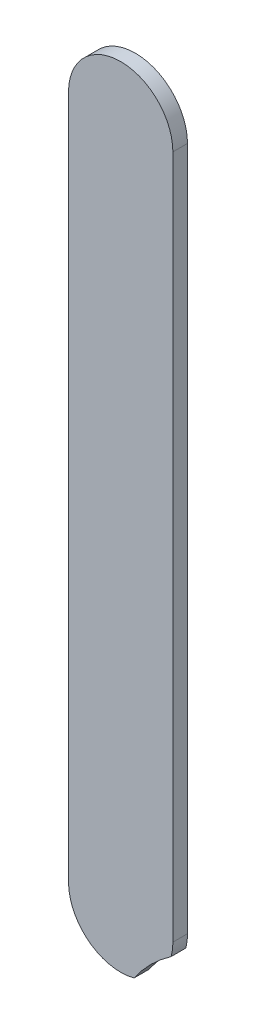
ISO-10303-21;
HEADER;
FILE_DESCRIPTION(('STEP AP214'),'2;1');
FILE_NAME('part.step','',(''),(''),'','','');
FILE_SCHEMA(('AUTOMOTIVE_DESIGN { 1 0 10303 214 1 1 1 1 }'));
ENDSEC;
DATA;
#1=APPLICATION_CONTEXT('core data for automotive mechanical design processes');
#2=APPLICATION_PROTOCOL_DEFINITION('international standard','automotive_design',2000,#1);
#3=PRODUCT_CONTEXT('',#1,'mechanical');
#4=PRODUCT('Part','Part','',(#3));
#5=PRODUCT_RELATED_PRODUCT_CATEGORY('part','',(#4));
#6=PRODUCT_DEFINITION_FORMATION('','',#4);
#7=PRODUCT_DEFINITION_CONTEXT('part definition',#1,'design');
#8=PRODUCT_DEFINITION('design','',#6,#7);
#9=PRODUCT_DEFINITION_SHAPE('','',#8);
#10=(LENGTH_UNIT() NAMED_UNIT(*) SI_UNIT(.MILLI.,.METRE.));
#11=(NAMED_UNIT(*) PLANE_ANGLE_UNIT() SI_UNIT($,.RADIAN.));
#12=(NAMED_UNIT(*) SI_UNIT($,.STERADIAN.) SOLID_ANGLE_UNIT());
#13=UNCERTAINTY_MEASURE_WITH_UNIT(LENGTH_MEASURE(1.E-05),#10,'distance_accuracy_value','');
#14=(GEOMETRIC_REPRESENTATION_CONTEXT(3) GLOBAL_UNCERTAINTY_ASSIGNED_CONTEXT((#13)) GLOBAL_UNIT_ASSIGNED_CONTEXT((#10,
#11,#12)) REPRESENTATION_CONTEXT('',''));
#15=CARTESIAN_POINT('',(0.,0.,0.));
#16=DIRECTION('',(0.,0.,1.));
#17=DIRECTION('',(1.,0.,0.));
#18=AXIS2_PLACEMENT_3D('',#15,#16,#17);
#19=CARTESIAN_POINT('',(88.4189748,73.91197054,0.));
#20=DIRECTION('',(-1.,0.,0.));
#21=DIRECTION('',(0.,1.,0.));
#22=AXIS2_PLACEMENT_3D('',#19,#20,#21);
#23=PLANE('',#22);
#24=DIRECTION('',(0.,1.,0.));
#25=VECTOR('',#24,1.);
#26=CARTESIAN_POINT('',(88.4189748,73.91197054,0.03556));
#27=LINE('',#26,#25);
#28=CARTESIAN_POINT('',(88.4189748,73.91197054,0.03556));
#29=VERTEX_POINT('',#28);
#30=CARTESIAN_POINT('',(88.4189748,75.5780048,0.03556));
#31=VERTEX_POINT('',#30);
#32=EDGE_CURVE('E11',#29,#31,#27,.T.);
#33=ORIENTED_EDGE('',*,*,#32,.F.);
#34=DIRECTION('',(0.,0.,1.));
#35=VECTOR('',#34,1.);
#36=CARTESIAN_POINT('',(88.4189748,73.91197054,0.));
#37=LINE('',#36,#35);
#38=CARTESIAN_POINT('',(88.4189748,73.91197054,0.));
#39=VERTEX_POINT('',#38);
#40=EDGE_CURVE('E24',#39,#29,#37,.T.);
#41=ORIENTED_EDGE('',*,*,#40,.F.);
#42=DIRECTION('',(0.,1.,0.));
#43=VECTOR('',#42,1.);
#44=CARTESIAN_POINT('',(88.4189748,73.91197054,0.));
#45=LINE('',#44,#43);
#46=CARTESIAN_POINT('',(88.4189748,75.5780048,0.));
#47=VERTEX_POINT('',#46);
#48=EDGE_CURVE('E88',#39,#47,#45,.T.);
#49=ORIENTED_EDGE('',*,*,#48,.T.);
#50=DIRECTION('',(0.,0.,1.));
#51=VECTOR('',#50,1.);
#52=CARTESIAN_POINT('',(88.4189748,75.5780048,0.));
#53=LINE('',#52,#51);
#54=EDGE_CURVE('E37',#47,#31,#53,.T.);
#55=ORIENTED_EDGE('',*,*,#54,.T.);
#56=EDGE_LOOP('',(#33,#41,#49,#55));
#57=FACE_BOUND('',#56,.T.);
#58=ADVANCED_FACE('F17',(#57),#23,.F.);
#59=CARTESIAN_POINT('',(88.2919748,75.5780048,0.));
#60=DIRECTION('',(0.,0.,-1.));
#61=DIRECTION('',(1.,0.,0.));
#62=AXIS2_PLACEMENT_3D('',#59,#60,#61);
#63=CYLINDRICAL_SURFACE('',#62,0.127);
#64=CARTESIAN_POINT('',(88.2919748,75.5780048,0.03556));
#65=DIRECTION('',(0.,0.,1.));
#66=DIRECTION('',(1.,0.,0.));
#67=AXIS2_PLACEMENT_3D('',#64,#65,#66);
#68=CIRCLE('',#67,0.127);
#69=CARTESIAN_POINT('',(88.1649748,75.5780048,0.03556));
#70=VERTEX_POINT('',#69);
#71=EDGE_CURVE('E121',#31,#70,#68,.T.);
#72=ORIENTED_EDGE('',*,*,#71,.F.);
#73=ORIENTED_EDGE('',*,*,#54,.F.);
#74=CARTESIAN_POINT('',(88.2919748,75.5780048,0.));
#75=DIRECTION('',(0.,0.,1.));
#76=DIRECTION('',(1.,0.,0.));
#77=AXIS2_PLACEMENT_3D('',#74,#75,#76);
#78=CIRCLE('',#77,0.127);
#79=CARTESIAN_POINT('',(88.1649748,75.5780048,0.));
#80=VERTEX_POINT('',#79);
#81=EDGE_CURVE('E119',#47,#80,#78,.T.);
#82=ORIENTED_EDGE('',*,*,#81,.T.);
#83=DIRECTION('',(0.,0.,1.));
#84=VECTOR('',#83,1.);
#85=CARTESIAN_POINT('',(88.1649748,75.5780048,0.));
#86=LINE('',#85,#84);
#87=EDGE_CURVE('E113',#80,#70,#86,.T.);
#88=ORIENTED_EDGE('',*,*,#87,.T.);
#89=EDGE_LOOP('',(#72,#73,#82,#88));
#90=FACE_BOUND('',#89,.T.);
#91=ADVANCED_FACE('F126',(#90),#63,.T.);
#92=CARTESIAN_POINT('',(88.1649748,75.5780048,0.));
#93=DIRECTION('',(1.,0.,0.));
#94=DIRECTION('',(0.,-1.,0.));
#95=AXIS2_PLACEMENT_3D('',#92,#93,#94);
#96=PLANE('',#95);
#97=DIRECTION('',(0.,-1.,0.));
#98=VECTOR('',#97,1.);
#99=CARTESIAN_POINT('',(88.1649748,75.5780048,0.03556));
#100=LINE('',#99,#98);
#101=CARTESIAN_POINT('',(88.1649748,73.91197054,0.03556));
#102=VERTEX_POINT('',#101);
#103=EDGE_CURVE('E105',#70,#102,#100,.T.);
#104=ORIENTED_EDGE('',*,*,#103,.F.);
#105=ORIENTED_EDGE('',*,*,#87,.F.);
#106=DIRECTION('',(0.,-1.,0.));
#107=VECTOR('',#106,1.);
#108=CARTESIAN_POINT('',(88.1649748,75.5780048,0.));
#109=LINE('',#108,#107);
#110=CARTESIAN_POINT('',(88.1649748,73.91197054,0.));
#111=VERTEX_POINT('',#110);
#112=EDGE_CURVE('E109',#80,#111,#109,.T.);
#113=ORIENTED_EDGE('',*,*,#112,.T.);
#114=DIRECTION('',(0.,0.,1.));
#115=VECTOR('',#114,1.);
#116=CARTESIAN_POINT('',(88.1649748,73.91197054,0.));
#117=LINE('',#116,#115);
#118=EDGE_CURVE('E97',#111,#102,#117,.T.);
#119=ORIENTED_EDGE('',*,*,#118,.T.);
#120=EDGE_LOOP('',(#104,#105,#113,#119));
#121=FACE_BOUND('',#120,.T.);
#122=ADVANCED_FACE('F112',(#121),#96,.F.);
#123=CARTESIAN_POINT('',(88.2919748,73.91197054,0.));
#124=DIRECTION('',(0.,0.,-1.));
#125=DIRECTION('',(-1.,0.,0.));
#126=AXIS2_PLACEMENT_3D('',#123,#124,#125);
#127=CYLINDRICAL_SURFACE('',#126,0.127);
#128=CARTESIAN_POINT('',(88.2919748,73.91197054,0.03556));
#129=DIRECTION('',(0.,0.,1.));
#130=DIRECTION('',(-1.,0.,0.));
#131=AXIS2_PLACEMENT_3D('',#128,#129,#130);
#132=CIRCLE('',#131,0.127);
#133=CARTESIAN_POINT('',(88.324473767856,73.7891991382474,0.03556));
#134=VERTEX_POINT('',#133);
#135=EDGE_CURVE('E94',#102,#134,#132,.T.);
#136=ORIENTED_EDGE('',*,*,#135,.F.);
#137=ORIENTED_EDGE('',*,*,#118,.F.);
#138=CARTESIAN_POINT('',(88.2919748,73.91197054,0.));
#139=DIRECTION('',(0.,0.,1.));
#140=DIRECTION('',(-1.,0.,0.));
#141=AXIS2_PLACEMENT_3D('',#138,#139,#140);
#142=CIRCLE('',#141,0.127);
#143=CARTESIAN_POINT('',(88.324473767856,73.7891991382474,0.));
#144=VERTEX_POINT('',#143);
#145=EDGE_CURVE('E90',#111,#144,#142,.T.);
#146=ORIENTED_EDGE('',*,*,#145,.T.);
#147=DIRECTION('',(0.,0.,1.));
#148=VECTOR('',#147,1.);
#149=CARTESIAN_POINT('',(88.324473767856,73.7891991382474,0.));
#150=LINE('',#149,#148);
#151=EDGE_CURVE('E75',#144,#134,#150,.T.);
#152=ORIENTED_EDGE('',*,*,#151,.T.);
#153=EDGE_LOOP('',(#136,#137,#146,#152));
#154=FACE_BOUND('',#153,.T.);
#155=ADVANCED_FACE('F106',(#154),#127,.T.);
#156=CARTESIAN_POINT('',(88.61697288,73.58697246,0.));
#157=DIRECTION('',(0.,0.,-1.));
#158=DIRECTION('',(1.,0.,0.));
#159=AXIS2_PLACEMENT_3D('',#156,#157,#158);
#160=CYLINDRICAL_SURFACE('',#159,0.3556);
#161=DIRECTION('',(0.,0.,1.));
#162=VECTOR('',#161,1.);
#163=CARTESIAN_POINT('',(88.4147462017526,73.879471572144,0.));
#164=LINE('',#163,#162);
#165=CARTESIAN_POINT('',(88.4147462017526,73.879471572144,0.));
#166=VERTEX_POINT('',#165);
#167=CARTESIAN_POINT('',(88.4147462017526,73.879471572144,0.03556));
#168=VERTEX_POINT('',#167);
#169=EDGE_CURVE('E65',#166,#168,#164,.T.);
#170=ORIENTED_EDGE('',*,*,#169,.T.);
#171=CARTESIAN_POINT('',(88.61697288,73.58697246,0.03556));
#172=DIRECTION('',(0.,0.,1.));
#173=DIRECTION('',(1.,0.,0.));
#174=AXIS2_PLACEMENT_3D('',#171,#172,#173);
#175=CIRCLE('',#174,0.3556);
#176=EDGE_CURVE('E76',#168,#134,#175,.T.);
#177=ORIENTED_EDGE('',*,*,#176,.T.);
#178=ORIENTED_EDGE('',*,*,#151,.F.);
#179=CARTESIAN_POINT('',(88.61697288,73.58697246,0.));
#180=DIRECTION('',(0.,0.,1.));
#181=DIRECTION('',(1.,0.,0.));
#182=AXIS2_PLACEMENT_3D('',#179,#180,#181);
#183=CIRCLE('',#182,0.3556);
#184=EDGE_CURVE('E79',#166,#144,#183,.T.);
#185=ORIENTED_EDGE('',*,*,#184,.F.);
#186=EDGE_LOOP('',(#170,#177,#178,#185));
#187=FACE_BOUND('',#186,.T.);
#188=ADVANCED_FACE('F80',(#187),#160,.F.);
#189=CARTESIAN_POINT('',(88.2919748,73.91197054,0.));
#190=DIRECTION('',(0.,0.,-1.));
#191=DIRECTION('',(-1.,0.,0.));
#192=AXIS2_PLACEMENT_3D('',#189,#190,#191);
#193=CYLINDRICAL_SURFACE('',#192,0.127);
#194=CARTESIAN_POINT('',(88.2919748,73.91197054,0.03556));
#195=DIRECTION('',(0.,0.,1.));
#196=DIRECTION('',(-1.,0.,0.));
#197=AXIS2_PLACEMENT_3D('',#194,#195,#196);
#198=CIRCLE('',#197,0.127);
#199=EDGE_CURVE('E71',#168,#29,#198,.T.);
#200=ORIENTED_EDGE('',*,*,#199,.F.);
#201=ORIENTED_EDGE('',*,*,#169,.F.);
#202=EDGE_CURVE('E69',#166,#39,#142,.T.);
#203=ORIENTED_EDGE('',*,*,#202,.T.);
#204=ORIENTED_EDGE('',*,*,#40,.T.);
#205=EDGE_LOOP('',(#200,#201,#203,#204));
#206=FACE_BOUND('',#205,.T.);
#207=ADVANCED_FACE('F67',(#206),#193,.T.);
#208=CARTESIAN_POINT('',(88.4189748,73.91197054,0.));
#209=DIRECTION('',(0.,0.,-1.));
#210=DIRECTION('',(-1.,0.,0.));
#211=AXIS2_PLACEMENT_3D('',#208,#209,#210);
#212=PLANE('',#211);
#213=ORIENTED_EDGE('',*,*,#48,.F.);
#214=ORIENTED_EDGE('',*,*,#202,.F.);
#215=ORIENTED_EDGE('',*,*,#184,.T.);
#216=ORIENTED_EDGE('',*,*,#145,.F.);
#217=ORIENTED_EDGE('',*,*,#112,.F.);
#218=ORIENTED_EDGE('',*,*,#81,.F.);
#219=EDGE_LOOP('',(#213,#214,#215,#216,#217,#218));
#220=FACE_BOUND('',#219,.T.);
#221=ADVANCED_FACE('F86',(#220),#212,.T.);
#222=CARTESIAN_POINT('',(88.4189748,73.91197054,0.03556));
#223=DIRECTION('',(0.,0.,-1.));
#224=DIRECTION('',(-1.,0.,0.));
#225=AXIS2_PLACEMENT_3D('',#222,#223,#224);
#226=PLANE('',#225);
#227=ORIENTED_EDGE('',*,*,#199,.T.);
#228=ORIENTED_EDGE('',*,*,#32,.T.);
#229=ORIENTED_EDGE('',*,*,#71,.T.);
#230=ORIENTED_EDGE('',*,*,#103,.T.);
#231=ORIENTED_EDGE('',*,*,#135,.T.);
#232=ORIENTED_EDGE('',*,*,#176,.F.);
#233=EDGE_LOOP('',(#227,#228,#229,#230,#231,#232));
#234=FACE_BOUND('',#233,.T.);
#235=ADVANCED_FACE('F101',(#234),#226,.F.);
#236=CLOSED_SHELL('',(#58,#91,#122,#155,#188,#207,#221,#235));
#237=MANIFOLD_SOLID_BREP('B1',#236);
#238=ADVANCED_BREP_SHAPE_REPRESENTATION('',(#18,#237),#14);
#239=SHAPE_DEFINITION_REPRESENTATION(#9,#238);
ENDSEC;
END-ISO-10303-21;
